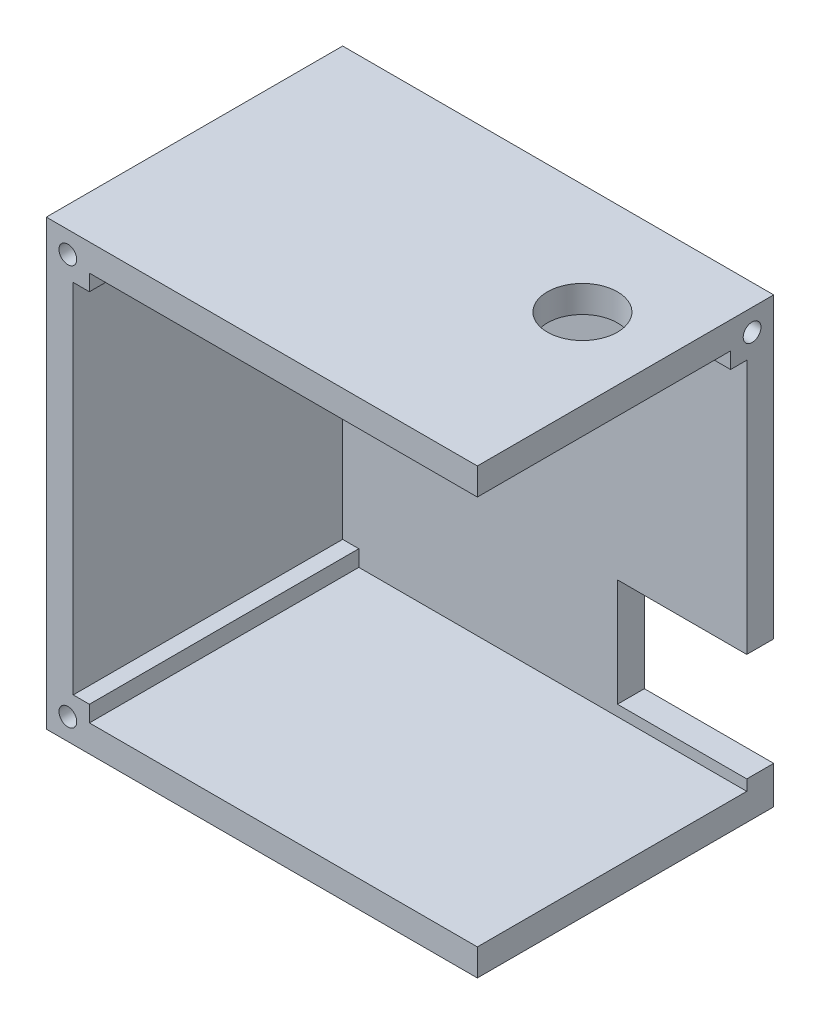
ISO-10303-21;
HEADER;
FILE_DESCRIPTION(('STEP AP214'),'2;1');
FILE_NAME('part.step','',(''),(''),'','','');
FILE_SCHEMA(('AUTOMOTIVE_DESIGN { 1 0 10303 214 1 1 1 1 }'));
ENDSEC;
DATA;
#1=APPLICATION_CONTEXT('core data for automotive mechanical design processes');
#2=APPLICATION_PROTOCOL_DEFINITION('international standard','automotive_design',2000,#1);
#3=PRODUCT_CONTEXT('',#1,'mechanical');
#4=PRODUCT('Part','Part','',(#3));
#5=PRODUCT_RELATED_PRODUCT_CATEGORY('part','',(#4));
#6=PRODUCT_DEFINITION_FORMATION('','',#4);
#7=PRODUCT_DEFINITION_CONTEXT('part definition',#1,'design');
#8=PRODUCT_DEFINITION('design','',#6,#7);
#9=PRODUCT_DEFINITION_SHAPE('','',#8);
#10=(LENGTH_UNIT() NAMED_UNIT(*) SI_UNIT(.MILLI.,.METRE.));
#11=(NAMED_UNIT(*) PLANE_ANGLE_UNIT() SI_UNIT($,.RADIAN.));
#12=(NAMED_UNIT(*) SI_UNIT($,.STERADIAN.) SOLID_ANGLE_UNIT());
#13=UNCERTAINTY_MEASURE_WITH_UNIT(LENGTH_MEASURE(1.E-05),#10,'distance_accuracy_value','');
#14=(GEOMETRIC_REPRESENTATION_CONTEXT(3) GLOBAL_UNCERTAINTY_ASSIGNED_CONTEXT((#13)) GLOBAL_UNIT_ASSIGNED_CONTEXT((#10,
#11,#12)) REPRESENTATION_CONTEXT('',''));
#15=CARTESIAN_POINT('',(0.,0.,0.));
#16=DIRECTION('',(0.,0.,1.));
#17=DIRECTION('',(1.,0.,0.));
#18=AXIS2_PLACEMENT_3D('',#15,#16,#17);
#19=CARTESIAN_POINT('',(80.,0.,55.));
#20=DIRECTION('',(-1.,0.,0.));
#21=DIRECTION('',(0.,0.,1.));
#22=AXIS2_PLACEMENT_3D('',#19,#20,#21);
#23=PLANE('',#22);
#24=CARTESIAN_POINT('',(80.,78.3,4.00464020260699));
#25=DIRECTION('',(1.,0.,0.));
#26=DIRECTION('',(0.,0.,-1.));
#27=AXIS2_PLACEMENT_3D('',#24,#25,#26);
#28=CIRCLE('',#27,1.65);
#29=CARTESIAN_POINT('',(80.,78.3,2.35464020260699));
#30=VERTEX_POINT('',#29);
#31=EDGE_CURVE('E215',#30,#30,#28,.T.);
#32=ORIENTED_EDGE('',*,*,#31,.F.);
#33=EDGE_LOOP('',(#32));
#34=FACE_BOUND('',#33,.T.);
#35=DIRECTION('',(0.,0.,1.));
#36=VECTOR('',#35,1.);
#37=CARTESIAN_POINT('',(80.,77.3,5.));
#38=LINE('',#37,#36);
#39=CARTESIAN_POINT('',(80.,77.3,8.));
#40=VERTEX_POINT('',#39);
#41=CARTESIAN_POINT('',(80.,77.3,55.));
#42=VERTEX_POINT('',#41);
#43=EDGE_CURVE('E338',#40,#42,#38,.T.);
#44=ORIENTED_EDGE('',*,*,#43,.F.);
#45=DIRECTION('',(0.,-1.,0.));
#46=VECTOR('',#45,1.);
#47=CARTESIAN_POINT('',(80.,77.3,8.));
#48=LINE('',#47,#46);
#49=CARTESIAN_POINT('',(80.,74.3,8.));
#50=VERTEX_POINT('',#49);
#51=EDGE_CURVE('E212',#40,#50,#48,.T.);
#52=ORIENTED_EDGE('',*,*,#51,.T.);
#53=DIRECTION('',(0.,0.,-1.));
#54=VECTOR('',#53,1.);
#55=CARTESIAN_POINT('',(80.,74.3,8.));
#56=LINE('',#55,#54);
#57=CARTESIAN_POINT('',(80.,74.3,5.));
#58=VERTEX_POINT('',#57);
#59=EDGE_CURVE('E196',#50,#58,#56,.T.);
#60=ORIENTED_EDGE('',*,*,#59,.T.);
#61=DIRECTION('',(0.,1.,0.));
#62=VECTOR('',#61,1.);
#63=CARTESIAN_POINT('',(80.,5.,5.));
#64=LINE('',#63,#62);
#65=CARTESIAN_POINT('',(80.,27.,5.));
#66=VERTEX_POINT('',#65);
#67=EDGE_CURVE('E316',#66,#58,#64,.T.);
#68=ORIENTED_EDGE('',*,*,#67,.F.);
#69=DIRECTION('',(0.,0.,1.));
#70=VECTOR('',#69,1.);
#71=CARTESIAN_POINT('',(80.,27.,-15.));
#72=LINE('',#71,#70);
#73=CARTESIAN_POINT('',(80.,27.,0.));
#74=VERTEX_POINT('',#73);
#75=EDGE_CURVE('E261',#74,#66,#72,.T.);
#76=ORIENTED_EDGE('',*,*,#75,.F.);
#77=DIRECTION('',(0.,1.,0.));
#78=VECTOR('',#77,1.);
#79=CARTESIAN_POINT('',(80.,0.,0.));
#80=LINE('',#79,#78);
#81=CARTESIAN_POINT('',(80.,82.3,0.));
#82=VERTEX_POINT('',#81);
#83=EDGE_CURVE('E373',#74,#82,#80,.T.);
#84=ORIENTED_EDGE('',*,*,#83,.T.);
#85=DIRECTION('',(0.,0.,-1.));
#86=VECTOR('',#85,1.);
#87=CARTESIAN_POINT('',(80.,82.3,55.));
#88=LINE('',#87,#86);
#89=CARTESIAN_POINT('',(80.,82.3,55.));
#90=VERTEX_POINT('',#89);
#91=EDGE_CURVE('E380',#90,#82,#88,.T.);
#92=ORIENTED_EDGE('',*,*,#91,.F.);
#93=DIRECTION('',(0.,1.,0.));
#94=VECTOR('',#93,1.);
#95=CARTESIAN_POINT('',(80.,0.,55.));
#96=LINE('',#95,#94);
#97=EDGE_CURVE('E362',#42,#90,#96,.T.);
#98=ORIENTED_EDGE('',*,*,#97,.F.);
#99=EDGE_LOOP('',(#44,#52,#60,#68,#76,#84,#92,#98));
#100=FACE_BOUND('',#99,.T.);
#101=ADVANCED_FACE('F36',(#34,#100),#23,.F.);
#102=CARTESIAN_POINT('',(0.,0.,55.));
#103=DIRECTION('',(1.,0.,0.));
#104=DIRECTION('',(0.,0.,-1.));
#105=AXIS2_PLACEMENT_3D('',#102,#103,#104);
#106=PLANE('',#105);
#107=DIRECTION('',(0.,-1.,0.));
#108=VECTOR('',#107,1.);
#109=CARTESIAN_POINT('',(0.,0.,0.));
#110=LINE('',#109,#108);
#111=CARTESIAN_POINT('',(0.,82.3,0.));
#112=VERTEX_POINT('',#111);
#113=CARTESIAN_POINT('',(0.,0.,0.));
#114=VERTEX_POINT('',#113);
#115=EDGE_CURVE('E340',#112,#114,#110,.T.);
#116=ORIENTED_EDGE('',*,*,#115,.T.);
#117=DIRECTION('',(0.,0.,-1.));
#118=VECTOR('',#117,1.);
#119=CARTESIAN_POINT('',(0.,0.,55.));
#120=LINE('',#119,#118);
#121=CARTESIAN_POINT('',(0.,0.,55.));
#122=VERTEX_POINT('',#121);
#123=EDGE_CURVE('E11',#122,#114,#120,.T.);
#124=ORIENTED_EDGE('',*,*,#123,.F.);
#125=DIRECTION('',(0.,-1.,0.));
#126=VECTOR('',#125,1.);
#127=CARTESIAN_POINT('',(0.,0.,55.));
#128=LINE('',#127,#126);
#129=CARTESIAN_POINT('',(0.,82.3,55.));
#130=VERTEX_POINT('',#129);
#131=EDGE_CURVE('E356',#130,#122,#128,.T.);
#132=ORIENTED_EDGE('',*,*,#131,.F.);
#133=DIRECTION('',(0.,0.,-1.));
#134=VECTOR('',#133,1.);
#135=CARTESIAN_POINT('',(0.,82.3,55.));
#136=LINE('',#135,#134);
#137=EDGE_CURVE('E368',#130,#112,#136,.T.);
#138=ORIENTED_EDGE('',*,*,#137,.T.);
#139=EDGE_LOOP('',(#116,#124,#132,#138));
#140=FACE_BOUND('',#139,.T.);
#141=ADVANCED_FACE('F38',(#140),#106,.F.);
#142=CARTESIAN_POINT('',(0.,0.,55.));
#143=DIRECTION('',(0.,1.,0.));
#144=DIRECTION('',(0.,0.,1.));
#145=AXIS2_PLACEMENT_3D('',#142,#143,#144);
#146=PLANE('',#145);
#147=DIRECTION('',(1.,0.,0.));
#148=VECTOR('',#147,1.);
#149=CARTESIAN_POINT('',(0.,0.,0.));
#150=LINE('',#149,#148);
#151=CARTESIAN_POINT('',(80.,0.,0.));
#152=VERTEX_POINT('',#151);
#153=EDGE_CURVE('E371',#114,#152,#150,.T.);
#154=ORIENTED_EDGE('',*,*,#153,.T.);
#155=DIRECTION('',(0.,0.,-1.));
#156=VECTOR('',#155,1.);
#157=CARTESIAN_POINT('',(80.,0.,55.));
#158=LINE('',#157,#156);
#159=CARTESIAN_POINT('',(80.,0.,55.));
#160=VERTEX_POINT('',#159);
#161=EDGE_CURVE('E44',#160,#152,#158,.T.);
#162=ORIENTED_EDGE('',*,*,#161,.F.);
#163=DIRECTION('',(1.,0.,0.));
#164=VECTOR('',#163,1.);
#165=CARTESIAN_POINT('',(0.,0.,55.));
#166=LINE('',#165,#164);
#167=EDGE_CURVE('E359',#122,#160,#166,.T.);
#168=ORIENTED_EDGE('',*,*,#167,.F.);
#169=ORIENTED_EDGE('',*,*,#123,.T.);
#170=EDGE_LOOP('',(#154,#162,#168,#169));
#171=FACE_BOUND('',#170,.T.);
#172=ADVANCED_FACE('F418',(#171),#146,.F.);
#173=CARTESIAN_POINT('',(80.,7.,0.));
#174=VERTEX_POINT('',#173);
#175=EDGE_CURVE('E374',#152,#174,#80,.T.);
#176=ORIENTED_EDGE('',*,*,#175,.T.);
#177=DIRECTION('',(0.,0.,1.));
#178=VECTOR('',#177,1.);
#179=CARTESIAN_POINT('',(80.,7.,-15.));
#180=LINE('',#179,#178);
#181=CARTESIAN_POINT('',(80.,7.,5.));
#182=VERTEX_POINT('',#181);
#183=EDGE_CURVE('E263',#174,#182,#180,.T.);
#184=ORIENTED_EDGE('',*,*,#183,.T.);
#185=CARTESIAN_POINT('',(80.,5.,5.));
#186=VERTEX_POINT('',#185);
#187=EDGE_CURVE('E317',#186,#182,#64,.T.);
#188=ORIENTED_EDGE('',*,*,#187,.F.);
#189=DIRECTION('',(0.,0.,1.));
#190=VECTOR('',#189,1.);
#191=CARTESIAN_POINT('',(80.,5.,5.));
#192=LINE('',#191,#190);
#193=CARTESIAN_POINT('',(80.,5.,55.));
#194=VERTEX_POINT('',#193);
#195=EDGE_CURVE('E341',#186,#194,#192,.T.);
#196=ORIENTED_EDGE('',*,*,#195,.T.);
#197=EDGE_CURVE('E363',#160,#194,#96,.T.);
#198=ORIENTED_EDGE('',*,*,#197,.F.);
#199=ORIENTED_EDGE('',*,*,#161,.T.);
#200=EDGE_LOOP('',(#176,#184,#188,#196,#198,#199));
#201=FACE_BOUND('',#200,.T.);
#202=ADVANCED_FACE('F387',(#201),#23,.F.);
#203=CARTESIAN_POINT('',(0.,82.3,55.));
#204=DIRECTION('',(0.,-1.,0.));
#205=DIRECTION('',(0.,0.,-1.));
#206=AXIS2_PLACEMENT_3D('',#203,#204,#205);
#207=PLANE('',#206);
#208=CARTESIAN_POINT('',(65.,82.3,20.5));
#209=DIRECTION('',(0.,-1.,0.));
#210=DIRECTION('',(0.,0.,-1.));
#211=AXIS2_PLACEMENT_3D('',#208,#209,#210);
#212=CIRCLE('',#211,6.5);
#213=CARTESIAN_POINT('',(65.,82.3,14.));
#214=VERTEX_POINT('',#213);
#215=EDGE_CURVE('E227',#214,#214,#212,.T.);
#216=ORIENTED_EDGE('',*,*,#215,.T.);
#217=EDGE_LOOP('',(#216));
#218=FACE_BOUND('',#217,.T.);
#219=DIRECTION('',(-1.,0.,0.));
#220=VECTOR('',#219,1.);
#221=CARTESIAN_POINT('',(0.,82.3,0.));
#222=LINE('',#221,#220);
#223=EDGE_CURVE('E360',#82,#112,#222,.T.);
#224=ORIENTED_EDGE('',*,*,#223,.T.);
#225=ORIENTED_EDGE('',*,*,#137,.F.);
#226=DIRECTION('',(-1.,0.,0.));
#227=VECTOR('',#226,1.);
#228=CARTESIAN_POINT('',(0.,82.3,55.));
#229=LINE('',#228,#227);
#230=EDGE_CURVE('E366',#90,#130,#229,.T.);
#231=ORIENTED_EDGE('',*,*,#230,.F.);
#232=ORIENTED_EDGE('',*,*,#91,.T.);
#233=EDGE_LOOP('',(#224,#225,#231,#232));
#234=FACE_BOUND('',#233,.T.);
#235=ADVANCED_FACE('F424',(#218,#234),#207,.F.);
#236=CARTESIAN_POINT('',(0.,0.,55.));
#237=DIRECTION('',(0.,0.,-1.));
#238=DIRECTION('',(-1.,0.,0.));
#239=AXIS2_PLACEMENT_3D('',#236,#237,#238);
#240=PLANE('',#239);
#241=CARTESIAN_POINT('',(4.,78.3,55.));
#242=DIRECTION('',(0.,0.,1.));
#243=DIRECTION('',(1.,0.,0.));
#244=AXIS2_PLACEMENT_3D('',#241,#242,#243);
#245=CIRCLE('',#244,1.65);
#246=CARTESIAN_POINT('',(5.65,78.3,55.));
#247=VERTEX_POINT('',#246);
#248=EDGE_CURVE('E287',#247,#247,#245,.T.);
#249=ORIENTED_EDGE('',*,*,#248,.F.);
#250=EDGE_LOOP('',(#249));
#251=FACE_BOUND('',#250,.T.);
#252=CARTESIAN_POINT('',(4.00000000000001,4.,55.));
#253=DIRECTION('',(0.,0.,1.));
#254=DIRECTION('',(1.,0.,0.));
#255=AXIS2_PLACEMENT_3D('',#252,#253,#254);
#256=CIRCLE('',#255,1.65);
#257=CARTESIAN_POINT('',(5.65000000000001,4.,55.));
#258=VERTEX_POINT('',#257);
#259=EDGE_CURVE('E282',#258,#258,#256,.T.);
#260=ORIENTED_EDGE('',*,*,#259,.F.);
#261=EDGE_LOOP('',(#260));
#262=FACE_BOUND('',#261,.T.);
#263=DIRECTION('',(0.,-1.,0.));
#264=VECTOR('',#263,1.);
#265=CARTESIAN_POINT('',(8.,74.3,55.));
#266=LINE('',#265,#264);
#267=CARTESIAN_POINT('',(8.,77.3,55.));
#268=VERTEX_POINT('',#267);
#269=CARTESIAN_POINT('',(8.,74.3,55.));
#270=VERTEX_POINT('',#269);
#271=EDGE_CURVE('E322',#268,#270,#266,.T.);
#272=ORIENTED_EDGE('',*,*,#271,.F.);
#273=DIRECTION('',(-1.,0.,0.));
#274=VECTOR('',#273,1.);
#275=CARTESIAN_POINT('',(8.,77.3,55.));
#276=LINE('',#275,#274);
#277=EDGE_CURVE('E286',#42,#268,#276,.T.);
#278=ORIENTED_EDGE('',*,*,#277,.F.);
#279=ORIENTED_EDGE('',*,*,#97,.T.);
#280=ORIENTED_EDGE('',*,*,#230,.T.);
#281=ORIENTED_EDGE('',*,*,#131,.T.);
#282=ORIENTED_EDGE('',*,*,#167,.T.);
#283=ORIENTED_EDGE('',*,*,#197,.T.);
#284=DIRECTION('',(1.,0.,0.));
#285=VECTOR('',#284,1.);
#286=CARTESIAN_POINT('',(8.00000000000001,5.,55.));
#287=LINE('',#286,#285);
#288=CARTESIAN_POINT('',(8.00000000000001,5.,55.));
#289=VERTEX_POINT('',#288);
#290=EDGE_CURVE('E298',#289,#194,#287,.T.);
#291=ORIENTED_EDGE('',*,*,#290,.F.);
#292=DIRECTION('',(0.,-1.,0.));
#293=VECTOR('',#292,1.);
#294=CARTESIAN_POINT('',(8.00000000000001,5.,55.));
#295=LINE('',#294,#293);
#296=CARTESIAN_POINT('',(8.00000000000001,8.,55.));
#297=VERTEX_POINT('',#296);
#298=EDGE_CURVE('E334',#297,#289,#295,.T.);
#299=ORIENTED_EDGE('',*,*,#298,.F.);
#300=DIRECTION('',(1.,0.,0.));
#301=VECTOR('',#300,1.);
#302=CARTESIAN_POINT('',(5.00000000000001,8.,55.));
#303=LINE('',#302,#301);
#304=CARTESIAN_POINT('',(5.00000000000001,8.,55.));
#305=VERTEX_POINT('',#304);
#306=EDGE_CURVE('E331',#305,#297,#303,.T.);
#307=ORIENTED_EDGE('',*,*,#306,.F.);
#308=DIRECTION('',(0.,-1.,0.));
#309=VECTOR('',#308,1.);
#310=CARTESIAN_POINT('',(5.00000000000001,8.,55.));
#311=LINE('',#310,#309);
#312=CARTESIAN_POINT('',(5.,74.3,55.));
#313=VERTEX_POINT('',#312);
#314=EDGE_CURVE('E328',#313,#305,#311,.T.);
#315=ORIENTED_EDGE('',*,*,#314,.F.);
#316=DIRECTION('',(-1.,0.,0.));
#317=VECTOR('',#316,1.);
#318=CARTESIAN_POINT('',(5.,74.3,55.));
#319=LINE('',#318,#317);
#320=EDGE_CURVE('E325',#270,#313,#319,.T.);
#321=ORIENTED_EDGE('',*,*,#320,.F.);
#322=EDGE_LOOP('',(#272,#278,#279,#280,#281,#282,#283,#291,#299,#307,#315,#321));
#323=FACE_BOUND('',#322,.T.);
#324=ADVANCED_FACE('F414',(#251,#262,#323),#240,.F.);
#325=CARTESIAN_POINT('',(0.,0.,0.));
#326=DIRECTION('',(0.,0.,-1.));
#327=DIRECTION('',(-1.,0.,0.));
#328=AXIS2_PLACEMENT_3D('',#325,#326,#327);
#329=PLANE('',#328);
#330=DIRECTION('',(0.,1.,0.));
#331=VECTOR('',#330,1.);
#332=CARTESIAN_POINT('',(10.5,0.,0.));
#333=LINE('',#332,#331);
#334=CARTESIAN_POINT('',(10.5,27.65,0.));
#335=VERTEX_POINT('',#334);
#336=CARTESIAN_POINT('',(10.5,54.65,0.));
#337=VERTEX_POINT('',#336);
#338=EDGE_CURVE('E280',#335,#337,#333,.T.);
#339=ORIENTED_EDGE('',*,*,#338,.F.);
#340=DIRECTION('',(-1.,0.,0.));
#341=VECTOR('',#340,1.);
#342=CARTESIAN_POINT('',(0.,27.65,0.));
#343=LINE('',#342,#341);
#344=CARTESIAN_POINT('',(25.5,27.65,0.));
#345=VERTEX_POINT('',#344);
#346=EDGE_CURVE('E273',#345,#335,#343,.T.);
#347=ORIENTED_EDGE('',*,*,#346,.F.);
#348=DIRECTION('',(0.,-1.,0.));
#349=VECTOR('',#348,1.);
#350=CARTESIAN_POINT('',(25.5,0.,0.));
#351=LINE('',#350,#349);
#352=CARTESIAN_POINT('',(25.5,54.65,0.));
#353=VERTEX_POINT('',#352);
#354=EDGE_CURVE('E275',#353,#345,#351,.T.);
#355=ORIENTED_EDGE('',*,*,#354,.F.);
#356=DIRECTION('',(1.,0.,0.));
#357=VECTOR('',#356,1.);
#358=CARTESIAN_POINT('',(0.,54.65,0.));
#359=LINE('',#358,#357);
#360=EDGE_CURVE('E278',#337,#353,#359,.T.);
#361=ORIENTED_EDGE('',*,*,#360,.F.);
#362=EDGE_LOOP('',(#339,#347,#355,#361));
#363=FACE_BOUND('',#362,.T.);
#364=DIRECTION('',(1.,0.,0.));
#365=VECTOR('',#364,1.);
#366=CARTESIAN_POINT('',(0.,27.,0.));
#367=LINE('',#366,#365);
#368=CARTESIAN_POINT('',(56.,27.,0.));
#369=VERTEX_POINT('',#368);
#370=EDGE_CURVE('E269',#369,#74,#367,.T.);
#371=ORIENTED_EDGE('',*,*,#370,.F.);
#372=DIRECTION('',(0.,1.,0.));
#373=VECTOR('',#372,1.);
#374=CARTESIAN_POINT('',(56.,0.,0.));
#375=LINE('',#374,#373);
#376=CARTESIAN_POINT('',(56.,7.,0.));
#377=VERTEX_POINT('',#376);
#378=EDGE_CURVE('E271',#377,#369,#375,.T.);
#379=ORIENTED_EDGE('',*,*,#378,.F.);
#380=DIRECTION('',(-1.,0.,0.));
#381=VECTOR('',#380,1.);
#382=CARTESIAN_POINT('',(0.,7.,0.));
#383=LINE('',#382,#381);
#384=EDGE_CURVE('E246',#174,#377,#383,.T.);
#385=ORIENTED_EDGE('',*,*,#384,.F.);
#386=ORIENTED_EDGE('',*,*,#175,.F.);
#387=ORIENTED_EDGE('',*,*,#153,.F.);
#388=ORIENTED_EDGE('',*,*,#115,.F.);
#389=ORIENTED_EDGE('',*,*,#223,.F.);
#390=ORIENTED_EDGE('',*,*,#83,.F.);
#391=EDGE_LOOP('',(#371,#379,#385,#386,#387,#388,#389,#390));
#392=FACE_BOUND('',#391,.T.);
#393=ADVANCED_FACE('F392',(#363,#392),#329,.T.);
#394=CARTESIAN_POINT('',(8.,77.3,5.));
#395=DIRECTION('',(0.,1.,0.));
#396=DIRECTION('',(0.,0.,1.));
#397=AXIS2_PLACEMENT_3D('',#394,#395,#396);
#398=PLANE('',#397);
#399=CARTESIAN_POINT('',(65.,77.3,20.5));
#400=DIRECTION('',(0.,-1.,0.));
#401=DIRECTION('',(0.,0.,-1.));
#402=AXIS2_PLACEMENT_3D('',#399,#400,#401);
#403=CIRCLE('',#402,6.5);
#404=CARTESIAN_POINT('',(65.,77.3,14.));
#405=VERTEX_POINT('',#404);
#406=EDGE_CURVE('E223',#405,#405,#403,.T.);
#407=ORIENTED_EDGE('',*,*,#406,.F.);
#408=EDGE_LOOP('',(#407));
#409=FACE_BOUND('',#408,.T.);
#410=DIRECTION('',(0.,0.,1.));
#411=VECTOR('',#410,1.);
#412=CARTESIAN_POINT('',(50.,77.3,8.));
#413=LINE('',#412,#411);
#414=CARTESIAN_POINT('',(50.,77.3,5.));
#415=VERTEX_POINT('',#414);
#416=CARTESIAN_POINT('',(50.,77.3,8.));
#417=VERTEX_POINT('',#416);
#418=EDGE_CURVE('E51',#415,#417,#413,.T.);
#419=ORIENTED_EDGE('',*,*,#418,.T.);
#420=DIRECTION('',(1.,0.,0.));
#421=VECTOR('',#420,1.);
#422=CARTESIAN_POINT('',(50.,77.3,8.));
#423=LINE('',#422,#421);
#424=EDGE_CURVE('E55',#417,#40,#423,.T.);
#425=ORIENTED_EDGE('',*,*,#424,.T.);
#426=ORIENTED_EDGE('',*,*,#43,.T.);
#427=ORIENTED_EDGE('',*,*,#277,.T.);
#428=DIRECTION('',(0.,0.,1.));
#429=VECTOR('',#428,1.);
#430=CARTESIAN_POINT('',(8.,77.3,5.));
#431=LINE('',#430,#429);
#432=CARTESIAN_POINT('',(8.,77.3,5.));
#433=VERTEX_POINT('',#432);
#434=EDGE_CURVE('E320',#433,#268,#431,.T.);
#435=ORIENTED_EDGE('',*,*,#434,.F.);
#436=DIRECTION('',(-1.,0.,0.));
#437=VECTOR('',#436,1.);
#438=CARTESIAN_POINT('',(8.,77.3,5.));
#439=LINE('',#438,#437);
#440=EDGE_CURVE('E295',#415,#433,#439,.T.);
#441=ORIENTED_EDGE('',*,*,#440,.F.);
#442=EDGE_LOOP('',(#419,#425,#426,#427,#435,#441));
#443=FACE_BOUND('',#442,.T.);
#444=ADVANCED_FACE('F498',(#409,#443),#398,.F.);
#445=CARTESIAN_POINT('',(8.00000000000001,5.,5.));
#446=DIRECTION('',(0.,-1.,0.));
#447=DIRECTION('',(0.,0.,-1.));
#448=AXIS2_PLACEMENT_3D('',#445,#446,#447);
#449=PLANE('',#448);
#450=ORIENTED_EDGE('',*,*,#290,.T.);
#451=ORIENTED_EDGE('',*,*,#195,.F.);
#452=DIRECTION('',(1.,0.,0.));
#453=VECTOR('',#452,1.);
#454=CARTESIAN_POINT('',(8.00000000000001,5.,5.));
#455=LINE('',#454,#453);
#456=CARTESIAN_POINT('',(8.00000000000001,5.,5.));
#457=VERTEX_POINT('',#456);
#458=EDGE_CURVE('E313',#457,#186,#455,.T.);
#459=ORIENTED_EDGE('',*,*,#458,.F.);
#460=DIRECTION('',(0.,0.,1.));
#461=VECTOR('',#460,1.);
#462=CARTESIAN_POINT('',(8.00000000000001,5.,5.));
#463=LINE('',#462,#461);
#464=EDGE_CURVE('E344',#457,#289,#463,.T.);
#465=ORIENTED_EDGE('',*,*,#464,.T.);
#466=EDGE_LOOP('',(#450,#451,#459,#465));
#467=FACE_BOUND('',#466,.T.);
#468=ADVANCED_FACE('F508',(#467),#449,.F.);
#469=CARTESIAN_POINT('',(8.00000000000001,5.,5.));
#470=DIRECTION('',(-1.,0.,0.));
#471=DIRECTION('',(0.,-1.,0.));
#472=AXIS2_PLACEMENT_3D('',#469,#470,#471);
#473=PLANE('',#472);
#474=ORIENTED_EDGE('',*,*,#298,.T.);
#475=ORIENTED_EDGE('',*,*,#464,.F.);
#476=DIRECTION('',(0.,-1.,0.));
#477=VECTOR('',#476,1.);
#478=CARTESIAN_POINT('',(8.00000000000001,5.,5.));
#479=LINE('',#478,#477);
#480=CARTESIAN_POINT('',(8.00000000000001,8.,5.));
#481=VERTEX_POINT('',#480);
#482=EDGE_CURVE('E310',#481,#457,#479,.T.);
#483=ORIENTED_EDGE('',*,*,#482,.F.);
#484=DIRECTION('',(0.,0.,1.));
#485=VECTOR('',#484,1.);
#486=CARTESIAN_POINT('',(8.00000000000001,8.,5.));
#487=LINE('',#486,#485);
#488=EDGE_CURVE('E346',#481,#297,#487,.T.);
#489=ORIENTED_EDGE('',*,*,#488,.T.);
#490=EDGE_LOOP('',(#474,#475,#483,#489));
#491=FACE_BOUND('',#490,.T.);
#492=ADVANCED_FACE('F517',(#491),#473,.F.);
#493=CARTESIAN_POINT('',(5.00000000000001,8.,5.));
#494=DIRECTION('',(0.,-1.,0.));
#495=DIRECTION('',(0.,0.,-1.));
#496=AXIS2_PLACEMENT_3D('',#493,#494,#495);
#497=PLANE('',#496);
#498=ORIENTED_EDGE('',*,*,#306,.T.);
#499=ORIENTED_EDGE('',*,*,#488,.F.);
#500=DIRECTION('',(1.,0.,0.));
#501=VECTOR('',#500,1.);
#502=CARTESIAN_POINT('',(5.00000000000001,8.,5.));
#503=LINE('',#502,#501);
#504=CARTESIAN_POINT('',(5.00000000000001,8.,5.));
#505=VERTEX_POINT('',#504);
#506=EDGE_CURVE('E307',#505,#481,#503,.T.);
#507=ORIENTED_EDGE('',*,*,#506,.F.);
#508=DIRECTION('',(0.,0.,1.));
#509=VECTOR('',#508,1.);
#510=CARTESIAN_POINT('',(5.00000000000001,8.,5.));
#511=LINE('',#510,#509);
#512=EDGE_CURVE('E348',#505,#305,#511,.T.);
#513=ORIENTED_EDGE('',*,*,#512,.T.);
#514=EDGE_LOOP('',(#498,#499,#507,#513));
#515=FACE_BOUND('',#514,.T.);
#516=ADVANCED_FACE('F525',(#515),#497,.F.);
#517=CARTESIAN_POINT('',(5.00000000000001,8.,5.));
#518=DIRECTION('',(-1.,0.,0.));
#519=DIRECTION('',(0.,-1.,0.));
#520=AXIS2_PLACEMENT_3D('',#517,#518,#519);
#521=PLANE('',#520);
#522=ORIENTED_EDGE('',*,*,#314,.T.);
#523=ORIENTED_EDGE('',*,*,#512,.F.);
#524=DIRECTION('',(0.,-1.,0.));
#525=VECTOR('',#524,1.);
#526=CARTESIAN_POINT('',(5.00000000000001,8.,5.));
#527=LINE('',#526,#525);
#528=CARTESIAN_POINT('',(5.,74.3,5.));
#529=VERTEX_POINT('',#528);
#530=EDGE_CURVE('E304',#529,#505,#527,.T.);
#531=ORIENTED_EDGE('',*,*,#530,.F.);
#532=DIRECTION('',(0.,0.,1.));
#533=VECTOR('',#532,1.);
#534=CARTESIAN_POINT('',(5.,74.3,5.));
#535=LINE('',#534,#533);
#536=EDGE_CURVE('E350',#529,#313,#535,.T.);
#537=ORIENTED_EDGE('',*,*,#536,.T.);
#538=EDGE_LOOP('',(#522,#523,#531,#537));
#539=FACE_BOUND('',#538,.T.);
#540=ADVANCED_FACE('F534',(#539),#521,.F.);
#541=CARTESIAN_POINT('',(5.,74.3,5.));
#542=DIRECTION('',(0.,1.,0.));
#543=DIRECTION('',(0.,0.,1.));
#544=AXIS2_PLACEMENT_3D('',#541,#542,#543);
#545=PLANE('',#544);
#546=ORIENTED_EDGE('',*,*,#320,.T.);
#547=ORIENTED_EDGE('',*,*,#536,.F.);
#548=DIRECTION('',(-1.,0.,0.));
#549=VECTOR('',#548,1.);
#550=CARTESIAN_POINT('',(5.,74.3,5.));
#551=LINE('',#550,#549);
#552=CARTESIAN_POINT('',(8.,74.3,5.));
#553=VERTEX_POINT('',#552);
#554=EDGE_CURVE('E301',#553,#529,#551,.T.);
#555=ORIENTED_EDGE('',*,*,#554,.F.);
#556=DIRECTION('',(0.,0.,1.));
#557=VECTOR('',#556,1.);
#558=CARTESIAN_POINT('',(8.,74.3,5.));
#559=LINE('',#558,#557);
#560=EDGE_CURVE('E352',#553,#270,#559,.T.);
#561=ORIENTED_EDGE('',*,*,#560,.T.);
#562=EDGE_LOOP('',(#546,#547,#555,#561));
#563=FACE_BOUND('',#562,.T.);
#564=ADVANCED_FACE('F543',(#563),#545,.F.);
#565=CARTESIAN_POINT('',(8.,74.3,5.));
#566=DIRECTION('',(-1.,0.,0.));
#567=DIRECTION('',(0.,-1.,0.));
#568=AXIS2_PLACEMENT_3D('',#565,#566,#567);
#569=PLANE('',#568);
#570=ORIENTED_EDGE('',*,*,#271,.T.);
#571=ORIENTED_EDGE('',*,*,#560,.F.);
#572=DIRECTION('',(0.,-1.,0.));
#573=VECTOR('',#572,1.);
#574=CARTESIAN_POINT('',(8.,74.3,5.));
#575=LINE('',#574,#573);
#576=EDGE_CURVE('E297',#433,#553,#575,.T.);
#577=ORIENTED_EDGE('',*,*,#576,.F.);
#578=ORIENTED_EDGE('',*,*,#434,.T.);
#579=EDGE_LOOP('',(#570,#571,#577,#578));
#580=FACE_BOUND('',#579,.T.);
#581=ADVANCED_FACE('F552',(#580),#569,.F.);
#582=CARTESIAN_POINT('',(0.,0.,5.));
#583=DIRECTION('',(0.,0.,1.));
#584=DIRECTION('',(1.,0.,0.));
#585=AXIS2_PLACEMENT_3D('',#582,#583,#584);
#586=PLANE('',#585);
#587=DIRECTION('',(1.,0.,0.));
#588=VECTOR('',#587,1.);
#589=CARTESIAN_POINT('',(50.,74.3,5.));
#590=LINE('',#589,#588);
#591=CARTESIAN_POINT('',(50.,74.3,5.));
#592=VERTEX_POINT('',#591);
#593=EDGE_CURVE('E201',#592,#58,#590,.T.);
#594=ORIENTED_EDGE('',*,*,#593,.F.);
#595=DIRECTION('',(0.,1.,0.));
#596=VECTOR('',#595,1.);
#597=CARTESIAN_POINT('',(50.,77.3,5.));
#598=LINE('',#597,#596);
#599=EDGE_CURVE('E208',#592,#415,#598,.T.);
#600=ORIENTED_EDGE('',*,*,#599,.T.);
#601=ORIENTED_EDGE('',*,*,#440,.T.);
#602=ORIENTED_EDGE('',*,*,#576,.T.);
#603=ORIENTED_EDGE('',*,*,#554,.T.);
#604=ORIENTED_EDGE('',*,*,#530,.T.);
#605=ORIENTED_EDGE('',*,*,#506,.T.);
#606=ORIENTED_EDGE('',*,*,#482,.T.);
#607=ORIENTED_EDGE('',*,*,#458,.T.);
#608=ORIENTED_EDGE('',*,*,#187,.T.);
#609=DIRECTION('',(1.,0.,0.));
#610=VECTOR('',#609,1.);
#611=CARTESIAN_POINT('',(56.,7.,5.));
#612=LINE('',#611,#610);
#613=CARTESIAN_POINT('',(56.,7.,5.));
#614=VERTEX_POINT('',#613);
#615=EDGE_CURVE('E254',#614,#182,#612,.T.);
#616=ORIENTED_EDGE('',*,*,#615,.F.);
#617=DIRECTION('',(0.,-1.,0.));
#618=VECTOR('',#617,1.);
#619=CARTESIAN_POINT('',(56.,27.,5.));
#620=LINE('',#619,#618);
#621=CARTESIAN_POINT('',(56.,27.,5.));
#622=VERTEX_POINT('',#621);
#623=EDGE_CURVE('E230',#622,#614,#620,.T.);
#624=ORIENTED_EDGE('',*,*,#623,.F.);
#625=DIRECTION('',(-1.,0.,0.));
#626=VECTOR('',#625,1.);
#627=CARTESIAN_POINT('',(56.,27.,5.));
#628=LINE('',#627,#626);
#629=EDGE_CURVE('E256',#66,#622,#628,.T.);
#630=ORIENTED_EDGE('',*,*,#629,.F.);
#631=ORIENTED_EDGE('',*,*,#67,.T.);
#632=EDGE_LOOP('',(#594,#600,#601,#602,#603,#604,#605,#606,#607,#608,#616,#624,#630,#631));
#633=FACE_BOUND('',#632,.T.);
#634=DIRECTION('',(0.,-1.,0.));
#635=VECTOR('',#634,1.);
#636=CARTESIAN_POINT('',(10.5,54.65,5.));
#637=LINE('',#636,#635);
#638=CARTESIAN_POINT('',(10.5,54.65,5.));
#639=VERTEX_POINT('',#638);
#640=CARTESIAN_POINT('',(10.5,27.65,5.));
#641=VERTEX_POINT('',#640);
#642=EDGE_CURVE('E231',#639,#641,#637,.T.);
#643=ORIENTED_EDGE('',*,*,#642,.F.);
#644=DIRECTION('',(-1.,0.,0.));
#645=VECTOR('',#644,1.);
#646=CARTESIAN_POINT('',(10.5,54.65,5.));
#647=LINE('',#646,#645);
#648=CARTESIAN_POINT('',(25.5,54.65,5.));
#649=VERTEX_POINT('',#648);
#650=EDGE_CURVE('E240',#649,#639,#647,.T.);
#651=ORIENTED_EDGE('',*,*,#650,.F.);
#652=DIRECTION('',(0.,1.,0.));
#653=VECTOR('',#652,1.);
#654=CARTESIAN_POINT('',(25.5,54.65,5.));
#655=LINE('',#654,#653);
#656=CARTESIAN_POINT('',(25.5,27.65,5.));
#657=VERTEX_POINT('',#656);
#658=EDGE_CURVE('E237',#657,#649,#655,.T.);
#659=ORIENTED_EDGE('',*,*,#658,.F.);
#660=DIRECTION('',(1.,0.,0.));
#661=VECTOR('',#660,1.);
#662=CARTESIAN_POINT('',(10.5,27.65,5.));
#663=LINE('',#662,#661);
#664=EDGE_CURVE('E233',#641,#657,#663,.T.);
#665=ORIENTED_EDGE('',*,*,#664,.F.);
#666=EDGE_LOOP('',(#643,#651,#659,#665));
#667=FACE_BOUND('',#666,.T.);
#668=ADVANCED_FACE('F405',(#633,#667),#586,.T.);
#669=CARTESIAN_POINT('',(4.00000000000001,4.,30.));
#670=DIRECTION('',(0.,0.,1.));
#671=DIRECTION('',(1.,0.,0.));
#672=AXIS2_PLACEMENT_3D('',#669,#670,#671);
#673=CYLINDRICAL_SURFACE('',#672,1.65);
#674=CARTESIAN_POINT('',(4.00000000000001,4.,30.));
#675=DIRECTION('',(0.,0.,1.));
#676=DIRECTION('',(1.,0.,0.));
#677=AXIS2_PLACEMENT_3D('',#674,#675,#676);
#678=CIRCLE('',#677,1.65);
#679=CARTESIAN_POINT('',(5.65000000000001,4.,30.));
#680=VERTEX_POINT('',#679);
#681=EDGE_CURVE('E290',#680,#680,#678,.T.);
#682=ORIENTED_EDGE('',*,*,#681,.F.);
#683=EDGE_LOOP('',(#682));
#684=FACE_BOUND('',#683,.T.);
#685=ORIENTED_EDGE('',*,*,#259,.T.);
#686=EDGE_LOOP('',(#685));
#687=FACE_BOUND('',#686,.T.);
#688=ADVANCED_FACE('F567',(#684,#687),#673,.F.);
#689=CARTESIAN_POINT('',(4.00000000000001,4.,30.));
#690=DIRECTION('',(0.,0.,1.));
#691=DIRECTION('',(1.,0.,0.));
#692=AXIS2_PLACEMENT_3D('',#689,#690,#691);
#693=PLANE('',#692);
#694=ORIENTED_EDGE('',*,*,#681,.T.);
#695=EDGE_LOOP('',(#694));
#696=FACE_BOUND('',#695,.T.);
#697=ADVANCED_FACE('F575',(#696),#693,.T.);
#698=CARTESIAN_POINT('',(4.,78.3,30.));
#699=DIRECTION('',(0.,0.,1.));
#700=DIRECTION('',(1.,0.,0.));
#701=AXIS2_PLACEMENT_3D('',#698,#699,#700);
#702=CYLINDRICAL_SURFACE('',#701,1.65);
#703=CARTESIAN_POINT('',(4.,78.3,30.));
#704=DIRECTION('',(0.,0.,1.));
#705=DIRECTION('',(1.,0.,0.));
#706=AXIS2_PLACEMENT_3D('',#703,#704,#705);
#707=CIRCLE('',#706,1.65);
#708=CARTESIAN_POINT('',(5.65,78.3,30.));
#709=VERTEX_POINT('',#708);
#710=EDGE_CURVE('E283',#709,#709,#707,.T.);
#711=ORIENTED_EDGE('',*,*,#710,.F.);
#712=EDGE_LOOP('',(#711));
#713=FACE_BOUND('',#712,.T.);
#714=ORIENTED_EDGE('',*,*,#248,.T.);
#715=EDGE_LOOP('',(#714));
#716=FACE_BOUND('',#715,.T.);
#717=ADVANCED_FACE('F584',(#713,#716),#702,.F.);
#718=CARTESIAN_POINT('',(4.,78.3,30.));
#719=DIRECTION('',(0.,0.,1.));
#720=DIRECTION('',(1.,0.,0.));
#721=AXIS2_PLACEMENT_3D('',#718,#719,#720);
#722=PLANE('',#721);
#723=ORIENTED_EDGE('',*,*,#710,.T.);
#724=EDGE_LOOP('',(#723));
#725=FACE_BOUND('',#724,.T.);
#726=ADVANCED_FACE('F440',(#725),#722,.T.);
#727=CARTESIAN_POINT('',(56.,27.,-15.));
#728=DIRECTION('',(-1.,0.,0.));
#729=DIRECTION('',(0.,0.,1.));
#730=AXIS2_PLACEMENT_3D('',#727,#728,#729);
#731=PLANE('',#730);
#732=ORIENTED_EDGE('',*,*,#378,.T.);
#733=DIRECTION('',(0.,0.,1.));
#734=VECTOR('',#733,1.);
#735=CARTESIAN_POINT('',(56.,27.,-15.));
#736=LINE('',#735,#734);
#737=EDGE_CURVE('E234',#369,#622,#736,.T.);
#738=ORIENTED_EDGE('',*,*,#737,.T.);
#739=ORIENTED_EDGE('',*,*,#623,.T.);
#740=DIRECTION('',(0.,0.,1.));
#741=VECTOR('',#740,1.);
#742=CARTESIAN_POINT('',(56.,7.,-15.));
#743=LINE('',#742,#741);
#744=EDGE_CURVE('E259',#377,#614,#743,.T.);
#745=ORIENTED_EDGE('',*,*,#744,.F.);
#746=EDGE_LOOP('',(#732,#738,#739,#745));
#747=FACE_BOUND('',#746,.T.);
#748=ADVANCED_FACE('F400',(#747),#731,.F.);
#749=CARTESIAN_POINT('',(56.,27.,-15.));
#750=DIRECTION('',(0.,1.,0.));
#751=DIRECTION('',(0.,0.,1.));
#752=AXIS2_PLACEMENT_3D('',#749,#750,#751);
#753=PLANE('',#752);
#754=ORIENTED_EDGE('',*,*,#370,.T.);
#755=ORIENTED_EDGE('',*,*,#75,.T.);
#756=ORIENTED_EDGE('',*,*,#629,.T.);
#757=ORIENTED_EDGE('',*,*,#737,.F.);
#758=EDGE_LOOP('',(#754,#755,#756,#757));
#759=FACE_BOUND('',#758,.T.);
#760=ADVANCED_FACE('F431',(#759),#753,.F.);
#761=CARTESIAN_POINT('',(56.,7.,-15.));
#762=DIRECTION('',(0.,-1.,0.));
#763=DIRECTION('',(1.,0.,0.));
#764=AXIS2_PLACEMENT_3D('',#761,#762,#763);
#765=PLANE('',#764);
#766=ORIENTED_EDGE('',*,*,#384,.T.);
#767=ORIENTED_EDGE('',*,*,#744,.T.);
#768=ORIENTED_EDGE('',*,*,#615,.T.);
#769=ORIENTED_EDGE('',*,*,#183,.F.);
#770=EDGE_LOOP('',(#766,#767,#768,#769));
#771=FACE_BOUND('',#770,.T.);
#772=ADVANCED_FACE('F397',(#771),#765,.F.);
#773=CARTESIAN_POINT('',(10.5,54.65,-15.));
#774=DIRECTION('',(-1.,0.,0.));
#775=DIRECTION('',(0.,0.,1.));
#776=AXIS2_PLACEMENT_3D('',#773,#774,#775);
#777=PLANE('',#776);
#778=ORIENTED_EDGE('',*,*,#338,.T.);
#779=DIRECTION('',(0.,0.,1.));
#780=VECTOR('',#779,1.);
#781=CARTESIAN_POINT('',(10.5,54.65,-15.));
#782=LINE('',#781,#780);
#783=EDGE_CURVE('E244',#337,#639,#782,.T.);
#784=ORIENTED_EDGE('',*,*,#783,.T.);
#785=ORIENTED_EDGE('',*,*,#642,.T.);
#786=DIRECTION('',(0.,0.,1.));
#787=VECTOR('',#786,1.);
#788=CARTESIAN_POINT('',(10.5,27.65,-15.));
#789=LINE('',#788,#787);
#790=EDGE_CURVE('E243',#335,#641,#789,.T.);
#791=ORIENTED_EDGE('',*,*,#790,.F.);
#792=EDGE_LOOP('',(#778,#784,#785,#791));
#793=FACE_BOUND('',#792,.T.);
#794=ADVANCED_FACE('F438',(#793),#777,.F.);
#795=CARTESIAN_POINT('',(10.5,54.65,-15.));
#796=DIRECTION('',(0.,1.,0.));
#797=DIRECTION('',(0.,0.,1.));
#798=AXIS2_PLACEMENT_3D('',#795,#796,#797);
#799=PLANE('',#798);
#800=ORIENTED_EDGE('',*,*,#360,.T.);
#801=DIRECTION('',(0.,0.,1.));
#802=VECTOR('',#801,1.);
#803=CARTESIAN_POINT('',(25.5,54.65,-15.));
#804=LINE('',#803,#802);
#805=EDGE_CURVE('E247',#353,#649,#804,.T.);
#806=ORIENTED_EDGE('',*,*,#805,.T.);
#807=ORIENTED_EDGE('',*,*,#650,.T.);
#808=ORIENTED_EDGE('',*,*,#783,.F.);
#809=EDGE_LOOP('',(#800,#806,#807,#808));
#810=FACE_BOUND('',#809,.T.);
#811=ADVANCED_FACE('F629',(#810),#799,.F.);
#812=CARTESIAN_POINT('',(25.5,54.65,-15.));
#813=DIRECTION('',(1.,0.,0.));
#814=DIRECTION('',(0.,0.,-1.));
#815=AXIS2_PLACEMENT_3D('',#812,#813,#814);
#816=PLANE('',#815);
#817=ORIENTED_EDGE('',*,*,#354,.T.);
#818=DIRECTION('',(0.,0.,1.));
#819=VECTOR('',#818,1.);
#820=CARTESIAN_POINT('',(25.5,27.65,-15.));
#821=LINE('',#820,#819);
#822=EDGE_CURVE('E249',#345,#657,#821,.T.);
#823=ORIENTED_EDGE('',*,*,#822,.T.);
#824=ORIENTED_EDGE('',*,*,#658,.T.);
#825=ORIENTED_EDGE('',*,*,#805,.F.);
#826=EDGE_LOOP('',(#817,#823,#824,#825));
#827=FACE_BOUND('',#826,.T.);
#828=ADVANCED_FACE('F637',(#827),#816,.F.);
#829=CARTESIAN_POINT('',(10.5,27.65,-15.));
#830=DIRECTION('',(0.,-1.,0.));
#831=DIRECTION('',(0.,0.,-1.));
#832=AXIS2_PLACEMENT_3D('',#829,#830,#831);
#833=PLANE('',#832);
#834=ORIENTED_EDGE('',*,*,#346,.T.);
#835=ORIENTED_EDGE('',*,*,#790,.T.);
#836=ORIENTED_EDGE('',*,*,#664,.T.);
#837=ORIENTED_EDGE('',*,*,#822,.F.);
#838=EDGE_LOOP('',(#834,#835,#836,#837));
#839=FACE_BOUND('',#838,.T.);
#840=ADVANCED_FACE('F646',(#839),#833,.F.);
#841=CARTESIAN_POINT('',(65.,97.3,20.5));
#842=DIRECTION('',(0.,-1.,0.));
#843=DIRECTION('',(0.,0.,-1.));
#844=AXIS2_PLACEMENT_3D('',#841,#842,#843);
#845=CYLINDRICAL_SURFACE('',#844,6.5);
#846=ORIENTED_EDGE('',*,*,#406,.T.);
#847=EDGE_LOOP('',(#846));
#848=FACE_BOUND('',#847,.T.);
#849=ORIENTED_EDGE('',*,*,#215,.F.);
#850=EDGE_LOOP('',(#849));
#851=FACE_BOUND('',#850,.T.);
#852=ADVANCED_FACE('F653',(#848,#851),#845,.F.);
#853=CARTESIAN_POINT('',(50.,77.3,8.));
#854=DIRECTION('',(0.,0.,1.));
#855=DIRECTION('',(1.,0.,0.));
#856=AXIS2_PLACEMENT_3D('',#853,#854,#855);
#857=PLANE('',#856);
#858=ORIENTED_EDGE('',*,*,#51,.F.);
#859=ORIENTED_EDGE('',*,*,#424,.F.);
#860=DIRECTION('',(0.,-1.,0.));
#861=VECTOR('',#860,1.);
#862=CARTESIAN_POINT('',(50.,77.3,8.));
#863=LINE('',#862,#861);
#864=CARTESIAN_POINT('',(50.,74.3,8.));
#865=VERTEX_POINT('',#864);
#866=EDGE_CURVE('E207',#417,#865,#863,.T.);
#867=ORIENTED_EDGE('',*,*,#866,.T.);
#868=DIRECTION('',(1.,0.,0.));
#869=VECTOR('',#868,1.);
#870=CARTESIAN_POINT('',(50.,74.3,8.));
#871=LINE('',#870,#869);
#872=EDGE_CURVE('E190',#865,#50,#871,.T.);
#873=ORIENTED_EDGE('',*,*,#872,.T.);
#874=EDGE_LOOP('',(#858,#859,#867,#873));
#875=FACE_BOUND('',#874,.T.);
#876=ADVANCED_FACE('F210',(#875),#857,.T.);
#877=CARTESIAN_POINT('',(50.,74.3,8.));
#878=DIRECTION('',(0.,-1.,0.));
#879=DIRECTION('',(0.,0.,-1.));
#880=AXIS2_PLACEMENT_3D('',#877,#878,#879);
#881=PLANE('',#880);
#882=ORIENTED_EDGE('',*,*,#59,.F.);
#883=ORIENTED_EDGE('',*,*,#872,.F.);
#884=DIRECTION('',(0.,0.,-1.));
#885=VECTOR('',#884,1.);
#886=CARTESIAN_POINT('',(50.,74.3,8.));
#887=LINE('',#886,#885);
#888=EDGE_CURVE('E194',#865,#592,#887,.T.);
#889=ORIENTED_EDGE('',*,*,#888,.T.);
#890=ORIENTED_EDGE('',*,*,#593,.T.);
#891=EDGE_LOOP('',(#882,#883,#889,#890));
#892=FACE_BOUND('',#891,.T.);
#893=ADVANCED_FACE('F192',(#892),#881,.T.);
#894=CARTESIAN_POINT('',(50.,0.,0.));
#895=DIRECTION('',(1.,0.,0.));
#896=DIRECTION('',(0.,0.,-1.));
#897=AXIS2_PLACEMENT_3D('',#894,#895,#896);
#898=PLANE('',#897);
#899=ORIENTED_EDGE('',*,*,#866,.F.);
#900=ORIENTED_EDGE('',*,*,#418,.F.);
#901=ORIENTED_EDGE('',*,*,#599,.F.);
#902=ORIENTED_EDGE('',*,*,#888,.F.);
#903=EDGE_LOOP('',(#899,#900,#901,#902));
#904=FACE_BOUND('',#903,.T.);
#905=ADVANCED_FACE('F206',(#904),#898,.F.);
#906=CARTESIAN_POINT('',(55.,78.3,4.00464020260699));
#907=DIRECTION('',(1.,0.,0.));
#908=DIRECTION('',(0.,0.,-1.));
#909=AXIS2_PLACEMENT_3D('',#906,#907,#908);
#910=CYLINDRICAL_SURFACE('',#909,1.65);
#911=CARTESIAN_POINT('',(55.,78.3,4.00464020260699));
#912=DIRECTION('',(1.,0.,0.));
#913=DIRECTION('',(0.,0.,-1.));
#914=AXIS2_PLACEMENT_3D('',#911,#912,#913);
#915=CIRCLE('',#914,1.65);
#916=CARTESIAN_POINT('',(55.,78.3,2.35464020260699));
#917=VERTEX_POINT('',#916);
#918=EDGE_CURVE('E220',#917,#917,#915,.T.);
#919=ORIENTED_EDGE('',*,*,#918,.F.);
#920=EDGE_LOOP('',(#919));
#921=FACE_BOUND('',#920,.T.);
#922=ORIENTED_EDGE('',*,*,#31,.T.);
#923=EDGE_LOOP('',(#922));
#924=FACE_BOUND('',#923,.T.);
#925=ADVANCED_FACE('F679',(#921,#924),#910,.F.);
#926=CARTESIAN_POINT('',(55.,78.3,4.00464020260699));
#927=DIRECTION('',(1.,0.,0.));
#928=DIRECTION('',(0.,0.,-1.));
#929=AXIS2_PLACEMENT_3D('',#926,#927,#928);
#930=PLANE('',#929);
#931=ORIENTED_EDGE('',*,*,#918,.T.);
#932=EDGE_LOOP('',(#931));
#933=FACE_BOUND('',#932,.T.);
#934=ADVANCED_FACE('F686',(#933),#930,.T.);
#935=CLOSED_SHELL('',(#101,#141,#172,#202,#235,#324,#393,#444,#468,#492,#516,#540,#564,#581,
#668,#688,#697,#717,#726,#748,#760,#772,#794,#811,#828,#840,#852,#876,#893,#905,#925,#934));
#936=MANIFOLD_SOLID_BREP('B2',#935);
#937=ADVANCED_BREP_SHAPE_REPRESENTATION('',(#18,#936),#14);
#938=SHAPE_DEFINITION_REPRESENTATION(#9,#937);
ENDSEC;
END-ISO-10303-21;
